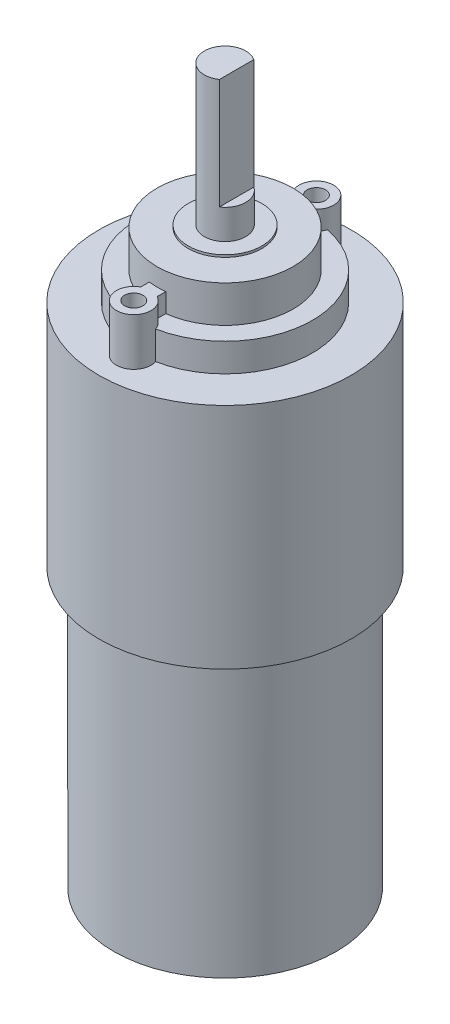
ISO-10303-21;
HEADER;
FILE_DESCRIPTION(('STEP AP214'),'2;1');
FILE_NAME('part.step','',(''),(''),'','','');
FILE_SCHEMA(('AUTOMOTIVE_DESIGN { 1 0 10303 214 1 1 1 1 }'));
ENDSEC;
DATA;
#1=APPLICATION_CONTEXT('core data for automotive mechanical design processes');
#2=APPLICATION_PROTOCOL_DEFINITION('international standard','automotive_design',2000,#1);
#3=PRODUCT_CONTEXT('',#1,'mechanical');
#4=PRODUCT('Part','Part','',(#3));
#5=PRODUCT_RELATED_PRODUCT_CATEGORY('part','',(#4));
#6=PRODUCT_DEFINITION_FORMATION('','',#4);
#7=PRODUCT_DEFINITION_CONTEXT('part definition',#1,'design');
#8=PRODUCT_DEFINITION('design','',#6,#7);
#9=PRODUCT_DEFINITION_SHAPE('','',#8);
#10=(LENGTH_UNIT() NAMED_UNIT(*) SI_UNIT(.MILLI.,.METRE.));
#11=(NAMED_UNIT(*) PLANE_ANGLE_UNIT() SI_UNIT($,.RADIAN.));
#12=(NAMED_UNIT(*) SI_UNIT($,.STERADIAN.) SOLID_ANGLE_UNIT());
#13=UNCERTAINTY_MEASURE_WITH_UNIT(LENGTH_MEASURE(1.E-05),#10,'distance_accuracy_value','');
#14=(GEOMETRIC_REPRESENTATION_CONTEXT(3) GLOBAL_UNCERTAINTY_ASSIGNED_CONTEXT((#13)) GLOBAL_UNIT_ASSIGNED_CONTEXT((#10,
#11,#12)) REPRESENTATION_CONTEXT('',''));
#15=CARTESIAN_POINT('',(0.,0.,0.));
#16=DIRECTION('',(0.,0.,1.));
#17=DIRECTION('',(1.,0.,0.));
#18=AXIS2_PLACEMENT_3D('',#15,#16,#17);
#19=CARTESIAN_POINT('',(10.0709448678522,27.8873951857923,22.4159740607033));
#20=DIRECTION('',(0.,1.,0.));
#21=DIRECTION('',(0.,0.,1.));
#22=AXIS2_PLACEMENT_3D('',#19,#20,#21);
#23=PLANE('',#22);
#24=DIRECTION('',(0.,0.,-1.));
#25=VECTOR('',#24,1.);
#26=CARTESIAN_POINT('',(9.17094486785221,27.8873951857923,0.));
#27=LINE('',#26,#25);
#28=CARTESIAN_POINT('',(9.17094486785221,27.8873951857923,30.6834299363854));
#29=VERTEX_POINT('',#28);
#30=CARTESIAN_POINT('',(9.17094486785221,27.8873951857923,29.7521237429938));
#31=VERTEX_POINT('',#30);
#32=EDGE_CURVE('E189',#29,#31,#27,.T.);
#33=ORIENTED_EDGE('',*,*,#32,.T.);
#34=CARTESIAN_POINT('',(10.0709448678522,27.8873951857923,22.4159740607033));
#35=DIRECTION('',(0.,1.,0.));
#36=DIRECTION('',(0.,0.,1.));
#37=AXIS2_PLACEMENT_3D('',#34,#35,#36);
#38=CIRCLE('',#37,7.39114958318201);
#39=CARTESIAN_POINT('',(9.1709448678522,27.8873951857923,15.0798243784128));
#40=VERTEX_POINT('',#39);
#41=EDGE_CURVE('E44',#31,#40,#38,.F.);
#42=ORIENTED_EDGE('',*,*,#41,.T.);
#43=DIRECTION('',(0.,0.,1.));
#44=VECTOR('',#43,1.);
#45=CARTESIAN_POINT('',(9.1709448678522,27.8873951857923,0.));
#46=LINE('',#45,#44);
#47=CARTESIAN_POINT('',(9.1709448678522,27.8873951857923,14.1485181850212));
#48=VERTEX_POINT('',#47);
#49=EDGE_CURVE('E199',#48,#40,#46,.T.);
#50=ORIENTED_EDGE('',*,*,#49,.F.);
#51=CARTESIAN_POINT('',(10.0709448678522,27.8873951857923,12.4959740607033));
#52=DIRECTION('',(0.,1.,0.));
#53=DIRECTION('',(0.,0.,1.));
#54=AXIS2_PLACEMENT_3D('',#51,#52,#53);
#55=CIRCLE('',#54,1.88172848275666);
#56=CARTESIAN_POINT('',(8.28396545185219,27.8873951857923,13.0855558189098));
#57=VERTEX_POINT('',#56);
#58=EDGE_CURVE('E202',#57,#48,#55,.T.);
#59=ORIENTED_EDGE('',*,*,#58,.F.);
#60=CARTESIAN_POINT('',(10.0709448678522,27.8873951857923,22.4159740607033));
#61=DIRECTION('',(0.,1.,0.));
#62=DIRECTION('',(0.,0.,1.));
#63=AXIS2_PLACEMENT_3D('',#60,#61,#62);
#64=CIRCLE('',#63,9.5);
#65=CARTESIAN_POINT('',(8.28396545185218,27.8873951857923,31.7463923024968));
#66=VERTEX_POINT('',#65);
#67=EDGE_CURVE('E174',#57,#66,#64,.T.);
#68=ORIENTED_EDGE('',*,*,#67,.T.);
#69=CARTESIAN_POINT('',(10.0709448678522,27.8873951857923,32.3359740607033));
#70=DIRECTION('',(0.,1.,0.));
#71=DIRECTION('',(0.,0.,1.));
#72=AXIS2_PLACEMENT_3D('',#69,#70,#71);
#73=CIRCLE('',#72,1.88172848275666);
#74=EDGE_CURVE('E198',#66,#29,#73,.F.);
#75=ORIENTED_EDGE('',*,*,#74,.T.);
#76=EDGE_LOOP('',(#33,#42,#50,#59,#68,#75));
#77=FACE_BOUND('',#76,.T.);
#78=ADVANCED_FACE('F36',(#77),#23,.T.);
#79=DIRECTION('',(0.,0.,1.));
#80=VECTOR('',#79,1.);
#81=CARTESIAN_POINT('',(10.9709448678522,27.8873951857923,0.));
#82=LINE('',#81,#80);
#83=CARTESIAN_POINT('',(10.9709448678522,27.8873951857923,14.1485181850212));
#84=VERTEX_POINT('',#83);
#85=CARTESIAN_POINT('',(10.9709448678522,27.8873951857923,15.0798243784128));
#86=VERTEX_POINT('',#85);
#87=EDGE_CURVE('E204',#84,#86,#82,.T.);
#88=ORIENTED_EDGE('',*,*,#87,.T.);
#89=CARTESIAN_POINT('',(10.0709448678522,27.8873951857923,22.4159740607033));
#90=DIRECTION('',(0.,1.,0.));
#91=DIRECTION('',(0.,0.,1.));
#92=AXIS2_PLACEMENT_3D('',#89,#90,#91);
#93=CIRCLE('',#92,7.39114958318201);
#94=CARTESIAN_POINT('',(10.9709448678522,27.8873951857923,29.7521237429938));
#95=VERTEX_POINT('',#94);
#96=EDGE_CURVE('E166',#95,#86,#93,.T.);
#97=ORIENTED_EDGE('',*,*,#96,.F.);
#98=DIRECTION('',(0.,0.,-1.));
#99=VECTOR('',#98,1.);
#100=CARTESIAN_POINT('',(10.9709448678522,27.8873951857923,0.));
#101=LINE('',#100,#99);
#102=CARTESIAN_POINT('',(10.9709448678522,27.8873951857923,30.6834299363854));
#103=VERTEX_POINT('',#102);
#104=EDGE_CURVE('E192',#103,#95,#101,.T.);
#105=ORIENTED_EDGE('',*,*,#104,.F.);
#106=CARTESIAN_POINT('',(11.8579242838522,27.8873951857923,31.7463923024968));
#107=VERTEX_POINT('',#106);
#108=EDGE_CURVE('E195',#103,#107,#73,.F.);
#109=ORIENTED_EDGE('',*,*,#108,.T.);
#110=CARTESIAN_POINT('',(11.8579242838522,27.8873951857923,13.0855558189098));
#111=VERTEX_POINT('',#110);
#112=EDGE_CURVE('E177',#107,#111,#64,.T.);
#113=ORIENTED_EDGE('',*,*,#112,.T.);
#114=EDGE_CURVE('E205',#84,#111,#55,.T.);
#115=ORIENTED_EDGE('',*,*,#114,.F.);
#116=EDGE_LOOP('',(#88,#97,#105,#109,#113,#115));
#117=FACE_BOUND('',#116,.T.);
#118=ADVANCED_FACE('F305',(#117),#23,.T.);
#119=CARTESIAN_POINT('',(10.0709448678522,29.962709459956,12.4959740607033));
#120=DIRECTION('',(0.,-1.,0.));
#121=DIRECTION('',(0.,0.,-1.));
#122=AXIS2_PLACEMENT_3D('',#119,#120,#121);
#123=CYLINDRICAL_SURFACE('',#122,1.88172848275666);
#124=DIRECTION('',(0.,-1.,0.));
#125=VECTOR('',#124,1.);
#126=CARTESIAN_POINT('',(8.28396545185218,26.3500523228741,13.0855558189098));
#127=LINE('',#126,#125);
#128=CARTESIAN_POINT('',(8.28396545185218,24.812709459956,13.0855558189098));
#129=VERTEX_POINT('',#128);
#130=EDGE_CURVE('E59',#57,#129,#127,.T.);
#131=ORIENTED_EDGE('',*,*,#130,.F.);
#132=ORIENTED_EDGE('',*,*,#58,.T.);
#133=DIRECTION('',(0.,-1.,0.));
#134=VECTOR('',#133,1.);
#135=CARTESIAN_POINT('',(9.1709448678522,29.962709459956,14.1485181850212));
#136=LINE('',#135,#134);
#137=CARTESIAN_POINT('',(9.1709448678522,29.962709459956,14.1485181850212));
#138=VERTEX_POINT('',#137);
#139=EDGE_CURVE('E260',#138,#48,#136,.T.);
#140=ORIENTED_EDGE('',*,*,#139,.F.);
#141=CARTESIAN_POINT('',(10.0709448678522,29.962709459956,12.4959740607033));
#142=DIRECTION('',(0.,1.,0.));
#143=DIRECTION('',(0.,0.,1.));
#144=AXIS2_PLACEMENT_3D('',#141,#142,#143);
#145=CIRCLE('',#144,1.88172848275666);
#146=CARTESIAN_POINT('',(10.9709448678522,29.962709459956,14.1485181850212));
#147=VERTEX_POINT('',#146);
#148=EDGE_CURVE('E243',#147,#138,#145,.T.);
#149=ORIENTED_EDGE('',*,*,#148,.F.);
#150=DIRECTION('',(0.,-1.,0.));
#151=VECTOR('',#150,1.);
#152=CARTESIAN_POINT('',(10.9709448678522,29.962709459956,14.1485181850212));
#153=LINE('',#152,#151);
#154=EDGE_CURVE('E263',#147,#84,#153,.T.);
#155=ORIENTED_EDGE('',*,*,#154,.T.);
#156=ORIENTED_EDGE('',*,*,#114,.T.);
#157=DIRECTION('',(0.,-1.,0.));
#158=VECTOR('',#157,1.);
#159=CARTESIAN_POINT('',(11.8579242838522,26.3500523228741,13.0855558189098));
#160=LINE('',#159,#158);
#161=CARTESIAN_POINT('',(11.8579242838522,24.812709459956,13.0855558189098));
#162=VERTEX_POINT('',#161);
#163=EDGE_CURVE('E185',#162,#111,#160,.F.);
#164=ORIENTED_EDGE('',*,*,#163,.F.);
#165=CARTESIAN_POINT('',(10.0709448678522,24.812709459956,12.4959740607033));
#166=DIRECTION('',(0.,1.,0.));
#167=DIRECTION('',(0.,0.,1.));
#168=AXIS2_PLACEMENT_3D('',#165,#166,#167);
#169=CIRCLE('',#168,1.88172848275666);
#170=EDGE_CURVE('E239',#162,#129,#169,.T.);
#171=ORIENTED_EDGE('',*,*,#170,.T.);
#172=EDGE_LOOP('',(#131,#132,#140,#149,#155,#156,#164,#171));
#173=FACE_BOUND('',#172,.T.);
#174=ADVANCED_FACE('F285',(#173),#123,.T.);
#175=CARTESIAN_POINT('',(10.0709448678522,29.962709459956,12.4959740607033));
#176=DIRECTION('',(0.,-1.,0.));
#177=DIRECTION('',(0.,0.,-1.));
#178=AXIS2_PLACEMENT_3D('',#175,#176,#177);
#179=CYLINDRICAL_SURFACE('',#178,1.);
#180=CARTESIAN_POINT('',(10.0709448678522,24.812709459956,12.4959740607033));
#181=DIRECTION('',(0.,1.,0.));
#182=DIRECTION('',(0.,0.,1.));
#183=AXIS2_PLACEMENT_3D('',#180,#181,#182);
#184=CIRCLE('',#183,1.);
#185=CARTESIAN_POINT('',(10.0709448678522,24.812709459956,13.4959740607033));
#186=VERTEX_POINT('',#185);
#187=EDGE_CURVE('E270',#186,#186,#184,.F.);
#188=ORIENTED_EDGE('',*,*,#187,.T.);
#189=EDGE_LOOP('',(#188));
#190=FACE_BOUND('',#189,.T.);
#191=CARTESIAN_POINT('',(10.0709448678522,29.962709459956,12.4959740607033));
#192=DIRECTION('',(0.,1.,0.));
#193=DIRECTION('',(0.,0.,1.));
#194=AXIS2_PLACEMENT_3D('',#191,#192,#193);
#195=CIRCLE('',#194,1.);
#196=CARTESIAN_POINT('',(10.0709448678522,29.962709459956,13.4959740607033));
#197=VERTEX_POINT('',#196);
#198=EDGE_CURVE('E251',#197,#197,#195,.T.);
#199=ORIENTED_EDGE('',*,*,#198,.T.);
#200=EDGE_LOOP('',(#199));
#201=FACE_BOUND('',#200,.T.);
#202=ADVANCED_FACE('F332',(#190,#201),#179,.F.);
#203=CARTESIAN_POINT('',(10.0709448678522,29.962709459956,32.3359740607033));
#204=DIRECTION('',(0.,-1.,0.));
#205=DIRECTION('',(0.,0.,-1.));
#206=AXIS2_PLACEMENT_3D('',#203,#204,#205);
#207=CYLINDRICAL_SURFACE('',#206,1.88172848275666);
#208=ORIENTED_EDGE('',*,*,#74,.F.);
#209=DIRECTION('',(0.,-1.,0.));
#210=VECTOR('',#209,1.);
#211=CARTESIAN_POINT('',(8.28396545185218,26.3500523228741,31.7463923024968));
#212=LINE('',#211,#210);
#213=CARTESIAN_POINT('',(8.28396545185218,24.812709459956,31.7463923024968));
#214=VERTEX_POINT('',#213);
#215=EDGE_CURVE('E181',#66,#214,#212,.T.);
#216=ORIENTED_EDGE('',*,*,#215,.T.);
#217=CARTESIAN_POINT('',(10.0709448678522,24.812709459956,32.3359740607033));
#218=DIRECTION('',(0.,1.,0.));
#219=DIRECTION('',(0.,0.,1.));
#220=AXIS2_PLACEMENT_3D('',#217,#218,#219);
#221=CIRCLE('',#220,1.88172848275666);
#222=CARTESIAN_POINT('',(11.8579242838522,24.812709459956,31.7463923024968));
#223=VERTEX_POINT('',#222);
#224=EDGE_CURVE('E224',#223,#214,#221,.F.);
#225=ORIENTED_EDGE('',*,*,#224,.F.);
#226=DIRECTION('',(0.,-1.,0.));
#227=VECTOR('',#226,1.);
#228=CARTESIAN_POINT('',(11.8579242838522,26.3500523228741,31.7463923024968));
#229=LINE('',#228,#227);
#230=EDGE_CURVE('E183',#223,#107,#229,.F.);
#231=ORIENTED_EDGE('',*,*,#230,.T.);
#232=ORIENTED_EDGE('',*,*,#108,.F.);
#233=DIRECTION('',(0.,-1.,0.));
#234=VECTOR('',#233,1.);
#235=CARTESIAN_POINT('',(10.9709448678522,29.962709459956,30.6834299363854));
#236=LINE('',#235,#234);
#237=CARTESIAN_POINT('',(10.9709448678522,29.962709459956,30.6834299363854));
#238=VERTEX_POINT('',#237);
#239=EDGE_CURVE('E236',#238,#103,#236,.T.);
#240=ORIENTED_EDGE('',*,*,#239,.F.);
#241=CARTESIAN_POINT('',(10.0709448678522,29.962709459956,32.3359740607033));
#242=DIRECTION('',(0.,1.,0.));
#243=DIRECTION('',(0.,0.,1.));
#244=AXIS2_PLACEMENT_3D('',#241,#242,#243);
#245=CIRCLE('',#244,1.88172848275666);
#246=CARTESIAN_POINT('',(9.17094486785221,29.962709459956,30.6834299363854));
#247=VERTEX_POINT('',#246);
#248=EDGE_CURVE('E208',#238,#247,#245,.F.);
#249=ORIENTED_EDGE('',*,*,#248,.T.);
#250=DIRECTION('',(0.,-1.,0.));
#251=VECTOR('',#250,1.);
#252=CARTESIAN_POINT('',(9.17094486785221,29.962709459956,30.6834299363854));
#253=LINE('',#252,#251);
#254=EDGE_CURVE('E223',#247,#29,#253,.T.);
#255=ORIENTED_EDGE('',*,*,#254,.T.);
#256=EDGE_LOOP('',(#208,#216,#225,#231,#232,#240,#249,#255));
#257=FACE_BOUND('',#256,.T.);
#258=ADVANCED_FACE('F293',(#257),#207,.T.);
#259=CARTESIAN_POINT('',(10.0709448678522,29.962709459956,32.3359740607033));
#260=DIRECTION('',(0.,-1.,0.));
#261=DIRECTION('',(0.,0.,-1.));
#262=AXIS2_PLACEMENT_3D('',#259,#260,#261);
#263=CYLINDRICAL_SURFACE('',#262,1.);
#264=CARTESIAN_POINT('',(10.0709448678522,24.812709459956,32.3359740607033));
#265=DIRECTION('',(0.,1.,0.));
#266=DIRECTION('',(0.,0.,1.));
#267=AXIS2_PLACEMENT_3D('',#264,#265,#266);
#268=CIRCLE('',#267,1.);
#269=CARTESIAN_POINT('',(10.0709448678522,24.812709459956,33.3359740607033));
#270=VERTEX_POINT('',#269);
#271=EDGE_CURVE('E212',#270,#270,#268,.F.);
#272=ORIENTED_EDGE('',*,*,#271,.T.);
#273=EDGE_LOOP('',(#272));
#274=FACE_BOUND('',#273,.T.);
#275=CARTESIAN_POINT('',(10.0709448678522,29.962709459956,32.3359740607033));
#276=DIRECTION('',(0.,1.,0.));
#277=DIRECTION('',(0.,0.,1.));
#278=AXIS2_PLACEMENT_3D('',#275,#276,#277);
#279=CIRCLE('',#278,1.);
#280=CARTESIAN_POINT('',(10.0709448678522,29.962709459956,33.3359740607033));
#281=VERTEX_POINT('',#280);
#282=EDGE_CURVE('E220',#281,#281,#279,.F.);
#283=ORIENTED_EDGE('',*,*,#282,.F.);
#284=EDGE_LOOP('',(#283));
#285=FACE_BOUND('',#284,.T.);
#286=ADVANCED_FACE('F340',(#274,#285),#263,.F.);
#287=CARTESIAN_POINT('',(10.0709448678522,24.812709459956,22.4159740607033));
#288=DIRECTION('',(0.,1.,0.));
#289=DIRECTION('',(0.,0.,1.));
#290=AXIS2_PLACEMENT_3D('',#287,#288,#289);
#291=PLANE('',#290);
#292=CARTESIAN_POINT('',(10.0709448678522,24.812709459956,22.4159740607033));
#293=DIRECTION('',(0.,1.,0.));
#294=DIRECTION('',(0.,0.,1.));
#295=AXIS2_PLACEMENT_3D('',#292,#293,#294);
#296=CIRCLE('',#295,13.7);
#297=CARTESIAN_POINT('',(10.0709448678522,24.812709459956,36.1159740607033));
#298=VERTEX_POINT('',#297);
#299=EDGE_CURVE('E267',#298,#298,#296,.T.);
#300=ORIENTED_EDGE('',*,*,#299,.T.);
#301=EDGE_LOOP('',(#300));
#302=FACE_BOUND('',#301,.T.);
#303=ORIENTED_EDGE('',*,*,#224,.T.);
#304=CARTESIAN_POINT('',(10.0709448678522,24.812709459956,22.4159740607033));
#305=DIRECTION('',(0.,1.,0.));
#306=DIRECTION('',(0.,0.,1.));
#307=AXIS2_PLACEMENT_3D('',#304,#305,#306);
#308=CIRCLE('',#307,9.5);
#309=EDGE_CURVE('E172',#129,#214,#308,.T.);
#310=ORIENTED_EDGE('',*,*,#309,.F.);
#311=ORIENTED_EDGE('',*,*,#170,.F.);
#312=EDGE_CURVE('E178',#223,#162,#308,.T.);
#313=ORIENTED_EDGE('',*,*,#312,.F.);
#314=EDGE_LOOP('',(#303,#310,#311,#313));
#315=FACE_BOUND('',#314,.T.);
#316=ADVANCED_FACE('F296',(#302,#315),#291,.T.);
#317=CARTESIAN_POINT('',(10.0709448678522,24.812709459956,22.4159740607033));
#318=DIRECTION('',(0.,-1.,0.));
#319=DIRECTION('',(0.,0.,-1.));
#320=AXIS2_PLACEMENT_3D('',#317,#318,#319);
#321=CYLINDRICAL_SURFACE('',#320,13.7);
#322=ORIENTED_EDGE('',*,*,#299,.F.);
#323=EDGE_LOOP('',(#322));
#324=FACE_BOUND('',#323,.T.);
#325=CARTESIAN_POINT('',(10.0709448678522,0.,22.4159740607033));
#326=DIRECTION('',(0.,1.,0.));
#327=DIRECTION('',(0.,0.,1.));
#328=AXIS2_PLACEMENT_3D('',#325,#326,#327);
#329=CIRCLE('',#328,13.7);
#330=CARTESIAN_POINT('',(10.0709448678522,0.,36.1159740607033));
#331=VERTEX_POINT('',#330);
#332=EDGE_CURVE('E266',#331,#331,#329,.T.);
#333=ORIENTED_EDGE('',*,*,#332,.T.);
#334=EDGE_LOOP('',(#333));
#335=FACE_BOUND('',#334,.T.);
#336=ADVANCED_FACE('F38',(#324,#335),#321,.T.);
#337=CARTESIAN_POINT('',(10.0709448678522,0.,22.4159740607033));
#338=DIRECTION('',(0.,1.,0.));
#339=DIRECTION('',(0.,0.,1.));
#340=AXIS2_PLACEMENT_3D('',#337,#338,#339);
#341=PLANE('',#340);
#342=CARTESIAN_POINT('',(10.0709448678522,0.,22.4159740607033));
#343=DIRECTION('',(0.,1.,0.));
#344=DIRECTION('',(0.,0.,1.));
#345=AXIS2_PLACEMENT_3D('',#342,#343,#344);
#346=CIRCLE('',#345,12.1);
#347=CARTESIAN_POINT('',(10.0709448678522,0.,34.5159740607033));
#348=VERTEX_POINT('',#347);
#349=EDGE_CURVE('E11',#348,#348,#346,.F.);
#350=ORIENTED_EDGE('',*,*,#349,.F.);
#351=EDGE_LOOP('',(#350));
#352=FACE_BOUND('',#351,.T.);
#353=ORIENTED_EDGE('',*,*,#332,.F.);
#354=EDGE_LOOP('',(#353));
#355=FACE_BOUND('',#354,.T.);
#356=ADVANCED_FACE('F566',(#352,#355),#341,.F.);
#357=CARTESIAN_POINT('',(10.9709448678522,29.962709459956,0.));
#358=DIRECTION('',(1.,0.,0.));
#359=DIRECTION('',(0.,0.,-1.));
#360=AXIS2_PLACEMENT_3D('',#357,#358,#359);
#361=PLANE('',#360);
#362=ORIENTED_EDGE('',*,*,#87,.F.);
#363=ORIENTED_EDGE('',*,*,#154,.F.);
#364=DIRECTION('',(0.,0.,1.));
#365=VECTOR('',#364,1.);
#366=CARTESIAN_POINT('',(10.9709448678522,29.962709459956,0.));
#367=LINE('',#366,#365);
#368=CARTESIAN_POINT('',(10.9709448678522,29.962709459956,15.0798243784128));
#369=VERTEX_POINT('',#368);
#370=EDGE_CURVE('E240',#147,#369,#367,.T.);
#371=ORIENTED_EDGE('',*,*,#370,.T.);
#372=DIRECTION('',(0.,-1.,0.));
#373=VECTOR('',#372,1.);
#374=CARTESIAN_POINT('',(10.9709448678522,29.962709459956,15.0798243784128));
#375=LINE('',#374,#373);
#376=EDGE_CURVE('E254',#369,#86,#375,.T.);
#377=ORIENTED_EDGE('',*,*,#376,.T.);
#378=EDGE_LOOP('',(#362,#363,#371,#377));
#379=FACE_BOUND('',#378,.T.);
#380=ADVANCED_FACE('F323',(#379),#361,.T.);
#381=CARTESIAN_POINT('',(9.1709448678522,29.962709459956,0.));
#382=DIRECTION('',(1.,0.,0.));
#383=DIRECTION('',(0.,0.,-1.));
#384=AXIS2_PLACEMENT_3D('',#381,#382,#383);
#385=PLANE('',#384);
#386=ORIENTED_EDGE('',*,*,#139,.T.);
#387=ORIENTED_EDGE('',*,*,#49,.T.);
#388=DIRECTION('',(0.,-1.,0.));
#389=VECTOR('',#388,1.);
#390=CARTESIAN_POINT('',(9.1709448678522,29.962709459956,15.0798243784128));
#391=LINE('',#390,#389);
#392=CARTESIAN_POINT('',(9.1709448678522,29.962709459956,15.0798243784128));
#393=VERTEX_POINT('',#392);
#394=EDGE_CURVE('E258',#393,#40,#391,.T.);
#395=ORIENTED_EDGE('',*,*,#394,.F.);
#396=DIRECTION('',(0.,0.,1.));
#397=VECTOR('',#396,1.);
#398=CARTESIAN_POINT('',(9.1709448678522,29.962709459956,0.));
#399=LINE('',#398,#397);
#400=EDGE_CURVE('E245',#138,#393,#399,.T.);
#401=ORIENTED_EDGE('',*,*,#400,.F.);
#402=EDGE_LOOP('',(#386,#387,#395,#401));
#403=FACE_BOUND('',#402,.T.);
#404=ADVANCED_FACE('F281',(#403),#385,.F.);
#405=CARTESIAN_POINT('',(0.,29.962709459956,0.));
#406=DIRECTION('',(0.,1.,0.));
#407=DIRECTION('',(0.,0.,1.));
#408=AXIS2_PLACEMENT_3D('',#405,#406,#407);
#409=PLANE('',#408);
#410=ORIENTED_EDGE('',*,*,#370,.F.);
#411=ORIENTED_EDGE('',*,*,#148,.T.);
#412=ORIENTED_EDGE('',*,*,#400,.T.);
#413=CARTESIAN_POINT('',(10.0709448678522,29.962709459956,22.4159740607033));
#414=DIRECTION('',(0.,1.,0.));
#415=DIRECTION('',(0.,0.,1.));
#416=AXIS2_PLACEMENT_3D('',#413,#414,#415);
#417=CIRCLE('',#416,7.39114958318201);
#418=EDGE_CURVE('E248',#393,#369,#417,.F.);
#419=ORIENTED_EDGE('',*,*,#418,.T.);
#420=EDGE_LOOP('',(#410,#411,#412,#419));
#421=FACE_BOUND('',#420,.T.);
#422=ORIENTED_EDGE('',*,*,#198,.F.);
#423=EDGE_LOOP('',(#422));
#424=FACE_BOUND('',#423,.T.);
#425=ADVANCED_FACE('F325',(#421,#424),#409,.T.);
#426=ORIENTED_EDGE('',*,*,#187,.F.);
#427=EDGE_LOOP('',(#426));
#428=FACE_BOUND('',#427,.T.);
#429=ADVANCED_FACE('F328',(#428),#291,.T.);
#430=CARTESIAN_POINT('',(10.9709448678522,29.962709459956,0.));
#431=DIRECTION('',(-1.,0.,0.));
#432=DIRECTION('',(0.,0.,1.));
#433=AXIS2_PLACEMENT_3D('',#430,#431,#432);
#434=PLANE('',#433);
#435=ORIENTED_EDGE('',*,*,#239,.T.);
#436=ORIENTED_EDGE('',*,*,#104,.T.);
#437=DIRECTION('',(0.,-1.,0.));
#438=VECTOR('',#437,1.);
#439=CARTESIAN_POINT('',(10.9709448678522,29.962709459956,29.7521237429938));
#440=LINE('',#439,#438);
#441=CARTESIAN_POINT('',(10.9709448678522,29.962709459956,29.7521237429938));
#442=VERTEX_POINT('',#441);
#443=EDGE_CURVE('E234',#442,#95,#440,.T.);
#444=ORIENTED_EDGE('',*,*,#443,.F.);
#445=DIRECTION('',(0.,0.,-1.));
#446=VECTOR('',#445,1.);
#447=CARTESIAN_POINT('',(10.9709448678522,29.962709459956,0.));
#448=LINE('',#447,#446);
#449=EDGE_CURVE('E211',#238,#442,#448,.T.);
#450=ORIENTED_EDGE('',*,*,#449,.F.);
#451=EDGE_LOOP('',(#435,#436,#444,#450));
#452=FACE_BOUND('',#451,.T.);
#453=ADVANCED_FACE('F310',(#452),#434,.F.);
#454=CARTESIAN_POINT('',(9.17094486785221,29.962709459956,0.));
#455=DIRECTION('',(-1.,0.,0.));
#456=DIRECTION('',(0.,0.,1.));
#457=AXIS2_PLACEMENT_3D('',#454,#455,#456);
#458=PLANE('',#457);
#459=ORIENTED_EDGE('',*,*,#32,.F.);
#460=ORIENTED_EDGE('',*,*,#254,.F.);
#461=DIRECTION('',(0.,0.,-1.));
#462=VECTOR('',#461,1.);
#463=CARTESIAN_POINT('',(9.17094486785221,29.962709459956,0.));
#464=LINE('',#463,#462);
#465=CARTESIAN_POINT('',(9.17094486785221,29.962709459956,29.7521237429938));
#466=VERTEX_POINT('',#465);
#467=EDGE_CURVE('E217',#247,#466,#464,.T.);
#468=ORIENTED_EDGE('',*,*,#467,.T.);
#469=DIRECTION('',(0.,-1.,0.));
#470=VECTOR('',#469,1.);
#471=CARTESIAN_POINT('',(9.17094486785221,29.962709459956,29.7521237429938));
#472=LINE('',#471,#470);
#473=EDGE_CURVE('E231',#466,#31,#472,.T.);
#474=ORIENTED_EDGE('',*,*,#473,.T.);
#475=EDGE_LOOP('',(#459,#460,#468,#474));
#476=FACE_BOUND('',#475,.T.);
#477=ADVANCED_FACE('F319',(#476),#458,.T.);
#478=CARTESIAN_POINT('',(0.,29.962709459956,0.));
#479=DIRECTION('',(0.,1.,0.));
#480=DIRECTION('',(0.,0.,1.));
#481=AXIS2_PLACEMENT_3D('',#478,#479,#480);
#482=PLANE('',#481);
#483=ORIENTED_EDGE('',*,*,#248,.F.);
#484=ORIENTED_EDGE('',*,*,#449,.T.);
#485=CARTESIAN_POINT('',(10.0709448678522,29.962709459956,22.4159740607033));
#486=DIRECTION('',(0.,1.,0.));
#487=DIRECTION('',(0.,0.,1.));
#488=AXIS2_PLACEMENT_3D('',#485,#486,#487);
#489=CIRCLE('',#488,7.39114958318201);
#490=EDGE_CURVE('E215',#466,#442,#489,.T.);
#491=ORIENTED_EDGE('',*,*,#490,.F.);
#492=ORIENTED_EDGE('',*,*,#467,.F.);
#493=EDGE_LOOP('',(#483,#484,#491,#492));
#494=FACE_BOUND('',#493,.T.);
#495=ORIENTED_EDGE('',*,*,#282,.T.);
#496=EDGE_LOOP('',(#495));
#497=FACE_BOUND('',#496,.T.);
#498=ADVANCED_FACE('F316',(#494,#497),#482,.T.);
#499=ORIENTED_EDGE('',*,*,#271,.F.);
#500=EDGE_LOOP('',(#499));
#501=FACE_BOUND('',#500,.T.);
#502=ADVANCED_FACE('F354',(#501),#291,.T.);
#503=CARTESIAN_POINT('',(10.0709448678522,27.8873951857923,22.4159740607033));
#504=DIRECTION('',(0.,-1.,0.));
#505=DIRECTION('',(0.,0.,-1.));
#506=AXIS2_PLACEMENT_3D('',#503,#504,#505);
#507=CYLINDRICAL_SURFACE('',#506,9.5);
#508=ORIENTED_EDGE('',*,*,#67,.F.);
#509=ORIENTED_EDGE('',*,*,#130,.T.);
#510=ORIENTED_EDGE('',*,*,#309,.T.);
#511=ORIENTED_EDGE('',*,*,#215,.F.);
#512=EDGE_LOOP('',(#508,#509,#510,#511));
#513=FACE_BOUND('',#512,.T.);
#514=ADVANCED_FACE('F290',(#513),#507,.T.);
#515=ORIENTED_EDGE('',*,*,#312,.T.);
#516=ORIENTED_EDGE('',*,*,#163,.T.);
#517=ORIENTED_EDGE('',*,*,#112,.F.);
#518=ORIENTED_EDGE('',*,*,#230,.F.);
#519=EDGE_LOOP('',(#515,#516,#517,#518));
#520=FACE_BOUND('',#519,.T.);
#521=ADVANCED_FACE('F300',(#520),#507,.T.);
#522=CARTESIAN_POINT('',(10.0709448678522,31.8873951857923,22.4159740607033));
#523=DIRECTION('',(0.,-1.,0.));
#524=DIRECTION('',(0.,0.,-1.));
#525=AXIS2_PLACEMENT_3D('',#522,#523,#524);
#526=CYLINDRICAL_SURFACE('',#525,7.39114958318201);
#527=ORIENTED_EDGE('',*,*,#376,.F.);
#528=ORIENTED_EDGE('',*,*,#418,.F.);
#529=ORIENTED_EDGE('',*,*,#394,.T.);
#530=ORIENTED_EDGE('',*,*,#41,.F.);
#531=ORIENTED_EDGE('',*,*,#473,.F.);
#532=ORIENTED_EDGE('',*,*,#490,.T.);
#533=ORIENTED_EDGE('',*,*,#443,.T.);
#534=ORIENTED_EDGE('',*,*,#96,.T.);
#535=EDGE_LOOP('',(#527,#528,#529,#530,#531,#532,#533,#534));
#536=FACE_BOUND('',#535,.T.);
#537=CARTESIAN_POINT('',(10.0709448678522,31.8873951857923,22.4159740607033));
#538=DIRECTION('',(0.,1.,0.));
#539=DIRECTION('',(0.,0.,1.));
#540=AXIS2_PLACEMENT_3D('',#537,#538,#539);
#541=CIRCLE('',#540,7.39114958318201);
#542=CARTESIAN_POINT('',(10.0709448678522,31.8873951857923,29.8071236438853));
#543=VERTEX_POINT('',#542);
#544=EDGE_CURVE('E169',#543,#543,#541,.T.);
#545=ORIENTED_EDGE('',*,*,#544,.F.);
#546=EDGE_LOOP('',(#545));
#547=FACE_BOUND('',#546,.T.);
#548=ADVANCED_FACE('F320',(#536,#547),#526,.T.);
#549=CARTESIAN_POINT('',(0.,31.8873951857923,0.));
#550=DIRECTION('',(0.,1.,0.));
#551=DIRECTION('',(0.,0.,1.));
#552=AXIS2_PLACEMENT_3D('',#549,#550,#551);
#553=PLANE('',#552);
#554=CARTESIAN_POINT('',(10.0709448678522,31.8873951857923,22.4159740607033));
#555=DIRECTION('',(0.,1.,0.));
#556=DIRECTION('',(0.,0.,1.));
#557=AXIS2_PLACEMENT_3D('',#554,#555,#556);
#558=CIRCLE('',#557,4.);
#559=CARTESIAN_POINT('',(10.0709448678522,31.8873951857923,26.4159740607033));
#560=VERTEX_POINT('',#559);
#561=EDGE_CURVE('E160',#560,#560,#558,.T.);
#562=ORIENTED_EDGE('',*,*,#561,.F.);
#563=EDGE_LOOP('',(#562));
#564=FACE_BOUND('',#563,.T.);
#565=ORIENTED_EDGE('',*,*,#544,.T.);
#566=EDGE_LOOP('',(#565));
#567=FACE_BOUND('',#566,.T.);
#568=ADVANCED_FACE('F400',(#564,#567),#553,.T.);
#569=CARTESIAN_POINT('',(10.0709448678522,32.1373951857923,22.4159740607033));
#570=DIRECTION('',(0.,-1.,0.));
#571=DIRECTION('',(0.,0.,-1.));
#572=AXIS2_PLACEMENT_3D('',#569,#570,#571);
#573=CYLINDRICAL_SURFACE('',#572,4.);
#574=CARTESIAN_POINT('',(10.0709448678522,32.1373951857923,22.4159740607033));
#575=DIRECTION('',(0.,1.,0.));
#576=DIRECTION('',(0.,0.,1.));
#577=AXIS2_PLACEMENT_3D('',#574,#575,#576);
#578=CIRCLE('',#577,4.);
#579=CARTESIAN_POINT('',(10.0709448678522,32.1373951857923,26.4159740607033));
#580=VERTEX_POINT('',#579);
#581=EDGE_CURVE('E163',#580,#580,#578,.T.);
#582=ORIENTED_EDGE('',*,*,#581,.F.);
#583=EDGE_LOOP('',(#582));
#584=FACE_BOUND('',#583,.T.);
#585=ORIENTED_EDGE('',*,*,#561,.T.);
#586=EDGE_LOOP('',(#585));
#587=FACE_BOUND('',#586,.T.);
#588=ADVANCED_FACE('F405',(#584,#587),#573,.T.);
#589=CARTESIAN_POINT('',(10.0709448678522,32.1373951857923,22.4159740607033));
#590=DIRECTION('',(0.,1.,0.));
#591=DIRECTION('',(0.,0.,1.));
#592=AXIS2_PLACEMENT_3D('',#589,#590,#591);
#593=PLANE('',#592);
#594=CARTESIAN_POINT('',(10.0709448678522,32.1373951857923,22.4159740607033));
#595=DIRECTION('',(0.,1.,0.));
#596=DIRECTION('',(0.,0.,1.));
#597=AXIS2_PLACEMENT_3D('',#594,#595,#596);
#598=CIRCLE('',#597,2.25);
#599=CARTESIAN_POINT('',(10.0709448678522,32.1373951857923,24.6659740607033));
#600=VERTEX_POINT('',#599);
#601=EDGE_CURVE('E155',#600,#600,#598,.T.);
#602=ORIENTED_EDGE('',*,*,#601,.F.);
#603=EDGE_LOOP('',(#602));
#604=FACE_BOUND('',#603,.T.);
#605=ORIENTED_EDGE('',*,*,#581,.T.);
#606=EDGE_LOOP('',(#605));
#607=FACE_BOUND('',#606,.T.);
#608=ADVANCED_FACE('F412',(#604,#607),#593,.T.);
#609=CARTESIAN_POINT('',(10.0709448678522,47.3623951857923,22.4159740607033));
#610=DIRECTION('',(0.,-1.,0.));
#611=DIRECTION('',(0.,0.,-1.));
#612=AXIS2_PLACEMENT_3D('',#609,#610,#611);
#613=CYLINDRICAL_SURFACE('',#612,2.25);
#614=CARTESIAN_POINT('',(10.0709448678522,47.3623951857923,22.4159740607033));
#615=DIRECTION('',(0.,1.,0.));
#616=DIRECTION('',(0.,0.,1.));
#617=AXIS2_PLACEMENT_3D('',#614,#615,#616);
#618=CIRCLE('',#617,2.25);
#619=CARTESIAN_POINT('',(11.3209448678522,47.3623951857923,20.5451453673163));
#620=VERTEX_POINT('',#619);
#621=CARTESIAN_POINT('',(11.3209448678522,47.3623951857923,24.2868027540903));
#622=VERTEX_POINT('',#621);
#623=EDGE_CURVE('E153',#620,#622,#618,.T.);
#624=ORIENTED_EDGE('',*,*,#623,.F.);
#625=DIRECTION('',(0.,1.,0.));
#626=VECTOR('',#625,1.);
#627=CARTESIAN_POINT('',(11.3209448678522,35.3623951857923,20.5451453673163));
#628=LINE('',#627,#626);
#629=CARTESIAN_POINT('',(11.3209448678522,35.3623951857923,20.5451453673163));
#630=VERTEX_POINT('',#629);
#631=EDGE_CURVE('E51',#630,#620,#628,.T.);
#632=ORIENTED_EDGE('',*,*,#631,.F.);
#633=CARTESIAN_POINT('',(10.0709448678522,35.3623951857923,22.4159740607033));
#634=DIRECTION('',(0.,1.,0.));
#635=DIRECTION('',(0.,0.,1.));
#636=AXIS2_PLACEMENT_3D('',#633,#634,#635);
#637=CIRCLE('',#636,2.25);
#638=CARTESIAN_POINT('',(11.3209448678522,35.3623951857923,24.2868027540903));
#639=VERTEX_POINT('',#638);
#640=EDGE_CURVE('E139',#639,#630,#637,.T.);
#641=ORIENTED_EDGE('',*,*,#640,.F.);
#642=DIRECTION('',(0.,1.,0.));
#643=VECTOR('',#642,1.);
#644=CARTESIAN_POINT('',(11.3209448678522,35.3623951857923,24.2868027540903));
#645=LINE('',#644,#643);
#646=EDGE_CURVE('E147',#639,#622,#645,.T.);
#647=ORIENTED_EDGE('',*,*,#646,.T.);
#648=EDGE_LOOP('',(#624,#632,#641,#647));
#649=FACE_BOUND('',#648,.T.);
#650=ORIENTED_EDGE('',*,*,#601,.T.);
#651=EDGE_LOOP('',(#650));
#652=FACE_BOUND('',#651,.T.);
#653=ADVANCED_FACE('F150',(#649,#652),#613,.T.);
#654=CARTESIAN_POINT('',(10.0709448678522,47.3623951857923,22.4159740607033));
#655=DIRECTION('',(0.,1.,0.));
#656=DIRECTION('',(0.,0.,1.));
#657=AXIS2_PLACEMENT_3D('',#654,#655,#656);
#658=PLANE('',#657);
#659=DIRECTION('',(0.,0.,1.));
#660=VECTOR('',#659,1.);
#661=CARTESIAN_POINT('',(11.3209448678522,47.3623951857923,0.));
#662=LINE('',#661,#660);
#663=EDGE_CURVE('E144',#620,#622,#662,.T.);
#664=ORIENTED_EDGE('',*,*,#663,.F.);
#665=ORIENTED_EDGE('',*,*,#623,.T.);
#666=EDGE_LOOP('',(#664,#665));
#667=FACE_BOUND('',#666,.T.);
#668=ADVANCED_FACE('F427',(#667),#658,.T.);
#669=CARTESIAN_POINT('',(11.3209448678522,35.3623951857923,0.));
#670=DIRECTION('',(-1.,0.,0.));
#671=DIRECTION('',(0.,0.,1.));
#672=AXIS2_PLACEMENT_3D('',#669,#670,#671);
#673=PLANE('',#672);
#674=ORIENTED_EDGE('',*,*,#663,.T.);
#675=ORIENTED_EDGE('',*,*,#646,.F.);
#676=DIRECTION('',(0.,0.,1.));
#677=VECTOR('',#676,1.);
#678=CARTESIAN_POINT('',(11.3209448678522,35.3623951857923,0.));
#679=LINE('',#678,#677);
#680=EDGE_CURVE('E141',#630,#639,#679,.T.);
#681=ORIENTED_EDGE('',*,*,#680,.F.);
#682=ORIENTED_EDGE('',*,*,#631,.T.);
#683=EDGE_LOOP('',(#674,#675,#681,#682));
#684=FACE_BOUND('',#683,.T.);
#685=ADVANCED_FACE('F146',(#684),#673,.F.);
#686=CARTESIAN_POINT('',(0.,35.3623951857923,0.));
#687=DIRECTION('',(0.,1.,0.));
#688=DIRECTION('',(0.,0.,1.));
#689=AXIS2_PLACEMENT_3D('',#686,#687,#688);
#690=PLANE('',#689);
#691=ORIENTED_EDGE('',*,*,#640,.T.);
#692=ORIENTED_EDGE('',*,*,#680,.T.);
#693=EDGE_LOOP('',(#691,#692));
#694=FACE_BOUND('',#693,.T.);
#695=ADVANCED_FACE('F140',(#694),#690,.T.);
#696=CARTESIAN_POINT('',(10.0709448678522,-30.2,22.4159740607033));
#697=DIRECTION('',(0.,1.,0.));
#698=DIRECTION('',(0.,0.,1.));
#699=AXIS2_PLACEMENT_3D('',#696,#697,#698);
#700=CYLINDRICAL_SURFACE('',#699,12.1);
#701=CARTESIAN_POINT('',(10.0709448678522,-30.2,22.4159740607033));
#702=DIRECTION('',(0.,-1.,0.));
#703=DIRECTION('',(0.,0.,-1.));
#704=AXIS2_PLACEMENT_3D('',#701,#702,#703);
#705=CIRCLE('',#704,12.1);
#706=CARTESIAN_POINT('',(10.0709448678522,-30.2,10.3159740607033));
#707=VERTEX_POINT('',#706);
#708=EDGE_CURVE('E621',#707,#707,#705,.T.);
#709=ORIENTED_EDGE('',*,*,#708,.F.);
#710=EDGE_LOOP('',(#709));
#711=FACE_BOUND('',#710,.T.);
#712=ORIENTED_EDGE('',*,*,#349,.T.);
#713=EDGE_LOOP('',(#712));
#714=FACE_BOUND('',#713,.T.);
#715=ADVANCED_FACE('F447',(#711,#714),#700,.T.);
#716=CARTESIAN_POINT('',(10.0709448678522,-30.2,22.4159740607033));
#717=DIRECTION('',(0.,-1.,0.));
#718=DIRECTION('',(0.,0.,-1.));
#719=AXIS2_PLACEMENT_3D('',#716,#717,#718);
#720=PLANE('',#719);
#721=ORIENTED_EDGE('',*,*,#708,.T.);
#722=EDGE_LOOP('',(#721));
#723=FACE_BOUND('',#722,.T.);
#724=ADVANCED_FACE('F455',(#723),#720,.T.);
#725=CLOSED_SHELL('',(#78,#118,#174,#202,#258,#286,#316,#336,#356,#380,#404,#425,#429,#453,#477,
#498,#502,#514,#521,#548,#568,#588,#608,#653,#668,#685,#695,#715,#724));
#726=MANIFOLD_SOLID_BREP('B2',#725);
#727=ADVANCED_BREP_SHAPE_REPRESENTATION('',(#18,#726),#14);
#728=SHAPE_DEFINITION_REPRESENTATION(#9,#727);
ENDSEC;
END-ISO-10303-21;
